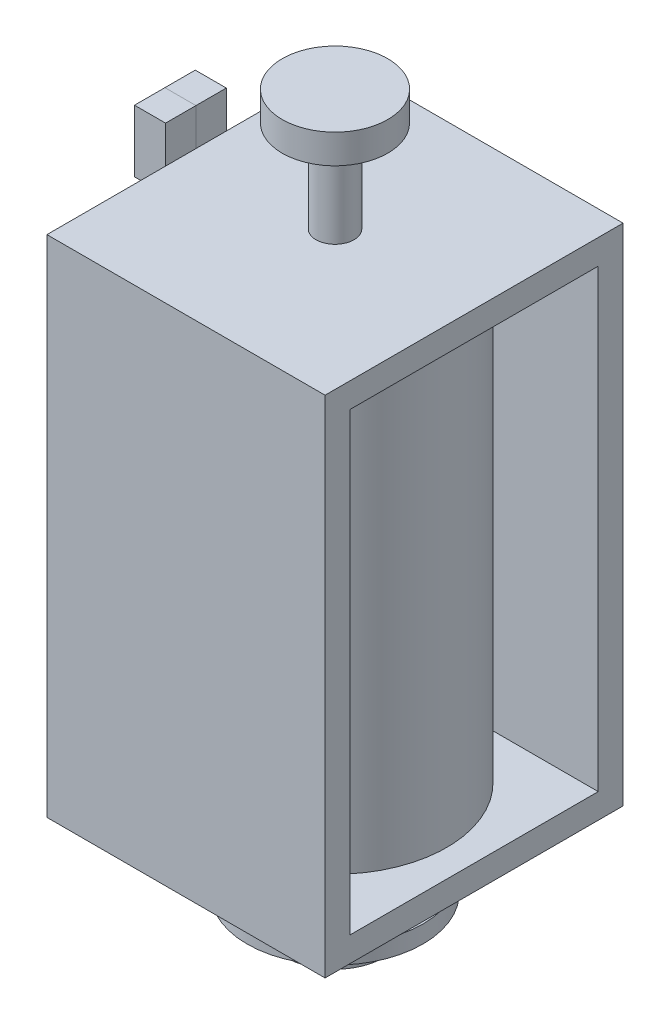
ISO-10303-21;
HEADER;
FILE_DESCRIPTION(('STEP AP214'),'2;1');
FILE_NAME('part.step','',(''),(''),'','','');
FILE_SCHEMA(('AUTOMOTIVE_DESIGN { 1 0 10303 214 1 1 1 1 }'));
ENDSEC;
DATA;
#1=APPLICATION_CONTEXT('core data for automotive mechanical design processes');
#2=APPLICATION_PROTOCOL_DEFINITION('international standard','automotive_design',2000,#1);
#3=PRODUCT_CONTEXT('',#1,'mechanical');
#4=PRODUCT('Part','Part','',(#3));
#5=PRODUCT_RELATED_PRODUCT_CATEGORY('part','',(#4));
#6=PRODUCT_DEFINITION_FORMATION('','',#4);
#7=PRODUCT_DEFINITION_CONTEXT('part definition',#1,'design');
#8=PRODUCT_DEFINITION('design','',#6,#7);
#9=PRODUCT_DEFINITION_SHAPE('','',#8);
#10=(LENGTH_UNIT() NAMED_UNIT(*) SI_UNIT(.MILLI.,.METRE.));
#11=(NAMED_UNIT(*) PLANE_ANGLE_UNIT() SI_UNIT($,.RADIAN.));
#12=(NAMED_UNIT(*) SI_UNIT($,.STERADIAN.) SOLID_ANGLE_UNIT());
#13=UNCERTAINTY_MEASURE_WITH_UNIT(LENGTH_MEASURE(1.E-05),#10,'distance_accuracy_value','');
#14=(GEOMETRIC_REPRESENTATION_CONTEXT(3) GLOBAL_UNCERTAINTY_ASSIGNED_CONTEXT((#13)) GLOBAL_UNIT_ASSIGNED_CONTEXT((#10,
#11,#12)) REPRESENTATION_CONTEXT('',''));
#15=CARTESIAN_POINT('',(0.,0.,0.));
#16=DIRECTION('',(0.,0.,1.));
#17=DIRECTION('',(1.,0.,0.));
#18=AXIS2_PLACEMENT_3D('',#15,#16,#17);
#19=CARTESIAN_POINT('',(0.,15.2781,0.));
#20=DIRECTION('',(0.,-1.,0.));
#21=DIRECTION('',(0.,0.,-1.));
#22=AXIS2_PLACEMENT_3D('',#19,#20,#21);
#23=CYLINDRICAL_SURFACE('',#22,2.159);
#24=CARTESIAN_POINT('',(0.,15.2781,0.));
#25=DIRECTION('',(0.,1.,0.));
#26=DIRECTION('',(0.,0.,1.));
#27=AXIS2_PLACEMENT_3D('',#24,#25,#26);
#28=CIRCLE('',#27,2.159);
#29=CARTESIAN_POINT('',(0.,15.2781,2.159));
#30=VERTEX_POINT('',#29);
#31=EDGE_CURVE('E11',#30,#30,#28,.T.);
#32=ORIENTED_EDGE('',*,*,#31,.F.);
#33=EDGE_LOOP('',(#32));
#34=FACE_BOUND('',#33,.T.);
#35=CARTESIAN_POINT('',(0.,14.0843,0.));
#36=DIRECTION('',(0.,1.,0.));
#37=DIRECTION('',(0.,0.,1.));
#38=AXIS2_PLACEMENT_3D('',#35,#36,#37);
#39=CIRCLE('',#38,2.159);
#40=CARTESIAN_POINT('',(0.,14.0843,2.159));
#41=VERTEX_POINT('',#40);
#42=EDGE_CURVE('E51',#41,#41,#39,.T.);
#43=ORIENTED_EDGE('',*,*,#42,.T.);
#44=EDGE_LOOP('',(#43));
#45=FACE_BOUND('',#44,.T.);
#46=ADVANCED_FACE('F48',(#34,#45),#23,.T.);
#47=CARTESIAN_POINT('',(0.,15.2781,0.));
#48=DIRECTION('',(0.,1.,0.));
#49=DIRECTION('',(0.,0.,1.));
#50=AXIS2_PLACEMENT_3D('',#47,#48,#49);
#51=PLANE('',#50);
#52=ORIENTED_EDGE('',*,*,#31,.T.);
#53=EDGE_LOOP('',(#52));
#54=FACE_BOUND('',#53,.T.);
#55=ADVANCED_FACE('F63',(#54),#51,.T.);
#56=CARTESIAN_POINT('',(0.,14.0843,0.));
#57=DIRECTION('',(0.,1.,0.));
#58=DIRECTION('',(0.,0.,1.));
#59=AXIS2_PLACEMENT_3D('',#56,#57,#58);
#60=PLANE('',#59);
#61=ORIENTED_EDGE('',*,*,#42,.F.);
#62=EDGE_LOOP('',(#61));
#63=FACE_BOUND('',#62,.T.);
#64=ADVANCED_FACE('F61',(#63),#60,.F.);
#65=CLOSED_SHELL('',(#46,#55,#64));
#66=MANIFOLD_SOLID_BREP('B2',#65);
#67=CARTESIAN_POINT('',(-6.9596,0.,1.24287012850082));
#68=DIRECTION('',(0.,0.,1.));
#69=DIRECTION('',(0.,-1.,0.));
#70=AXIS2_PLACEMENT_3D('',#67,#68,#69);
#71=PLANE('',#70);
#72=DIRECTION('',(0.,-1.,0.));
#73=VECTOR('',#72,1.);
#74=CARTESIAN_POINT('',(-5.6896,0.,1.24287012850082));
#75=LINE('',#74,#73);
#76=CARTESIAN_POINT('',(-5.6896,11.8491,1.24287012850082));
#77=VERTEX_POINT('',#76);
#78=CARTESIAN_POINT('',(-5.6896,9.3091,1.24287012850082));
#79=VERTEX_POINT('',#78);
#80=EDGE_CURVE('E162',#77,#79,#75,.T.);
#81=ORIENTED_EDGE('',*,*,#80,.F.);
#82=DIRECTION('',(1.,0.,0.));
#83=VECTOR('',#82,1.);
#84=CARTESIAN_POINT('',(-6.9596,11.8491,1.24287012850082));
#85=LINE('',#84,#83);
#86=CARTESIAN_POINT('',(-6.9596,11.8491,1.24287012850082));
#87=VERTEX_POINT('',#86);
#88=EDGE_CURVE('E46',#87,#77,#85,.T.);
#89=ORIENTED_EDGE('',*,*,#88,.F.);
#90=DIRECTION('',(0.,-1.,0.));
#91=VECTOR('',#90,1.);
#92=CARTESIAN_POINT('',(-6.9596,0.,1.24287012850082));
#93=LINE('',#92,#91);
#94=CARTESIAN_POINT('',(-6.9596,9.3091,1.24287012850082));
#95=VERTEX_POINT('',#94);
#96=EDGE_CURVE('E155',#87,#95,#93,.T.);
#97=ORIENTED_EDGE('',*,*,#96,.T.);
#98=DIRECTION('',(1.,0.,0.));
#99=VECTOR('',#98,1.);
#100=CARTESIAN_POINT('',(-6.9596,9.3091,1.24287012850082));
#101=LINE('',#100,#99);
#102=EDGE_CURVE('E137',#95,#79,#101,.T.);
#103=ORIENTED_EDGE('',*,*,#102,.T.);
#104=EDGE_LOOP('',(#81,#89,#97,#103));
#105=FACE_BOUND('',#104,.T.);
#106=ADVANCED_FACE('F99',(#105),#71,.T.);
#107=CARTESIAN_POINT('',(-6.9596,11.8491,0.));
#108=DIRECTION('',(0.,1.,0.));
#109=DIRECTION('',(0.,0.,1.));
#110=AXIS2_PLACEMENT_3D('',#107,#108,#109);
#111=PLANE('',#110);
#112=DIRECTION('',(0.,0.,1.));
#113=VECTOR('',#112,1.);
#114=CARTESIAN_POINT('',(-5.6896,11.8491,0.));
#115=LINE('',#114,#113);
#116=CARTESIAN_POINT('',(-5.6896,11.8491,0.));
#117=VERTEX_POINT('',#116);
#118=EDGE_CURVE('E148',#117,#77,#115,.T.);
#119=ORIENTED_EDGE('',*,*,#118,.F.);
#120=DIRECTION('',(1.,0.,0.));
#121=VECTOR('',#120,1.);
#122=CARTESIAN_POINT('',(-6.9596,11.8491,0.));
#123=LINE('',#122,#121);
#124=CARTESIAN_POINT('',(-6.9596,11.8491,0.));
#125=VERTEX_POINT('',#124);
#126=EDGE_CURVE('E107',#125,#117,#123,.T.);
#127=ORIENTED_EDGE('',*,*,#126,.F.);
#128=DIRECTION('',(0.,0.,1.));
#129=VECTOR('',#128,1.);
#130=CARTESIAN_POINT('',(-6.9596,11.8491,0.));
#131=LINE('',#130,#129);
#132=EDGE_CURVE('E146',#125,#87,#131,.T.);
#133=ORIENTED_EDGE('',*,*,#132,.T.);
#134=ORIENTED_EDGE('',*,*,#88,.T.);
#135=EDGE_LOOP('',(#119,#127,#133,#134));
#136=FACE_BOUND('',#135,.T.);
#137=ADVANCED_FACE('F145',(#136),#111,.T.);
#138=CARTESIAN_POINT('',(-6.9596,0.,0.));
#139=DIRECTION('',(0.,0.,-1.));
#140=DIRECTION('',(-1.,0.,0.));
#141=AXIS2_PLACEMENT_3D('',#138,#139,#140);
#142=PLANE('',#141);
#143=DIRECTION('',(0.,1.,0.));
#144=VECTOR('',#143,1.);
#145=CARTESIAN_POINT('',(-5.6896,0.,0.));
#146=LINE('',#145,#144);
#147=CARTESIAN_POINT('',(-5.6896,9.3091,0.));
#148=VERTEX_POINT('',#147);
#149=EDGE_CURVE('E166',#148,#117,#146,.T.);
#150=ORIENTED_EDGE('',*,*,#149,.F.);
#151=DIRECTION('',(1.,0.,0.));
#152=VECTOR('',#151,1.);
#153=CARTESIAN_POINT('',(-6.9596,9.3091,0.));
#154=LINE('',#153,#152);
#155=CARTESIAN_POINT('',(-6.9596,9.3091,0.));
#156=VERTEX_POINT('',#155);
#157=EDGE_CURVE('E130',#156,#148,#154,.T.);
#158=ORIENTED_EDGE('',*,*,#157,.F.);
#159=DIRECTION('',(0.,1.,0.));
#160=VECTOR('',#159,1.);
#161=CARTESIAN_POINT('',(-6.9596,0.,0.));
#162=LINE('',#161,#160);
#163=EDGE_CURVE('E154',#156,#125,#162,.T.);
#164=ORIENTED_EDGE('',*,*,#163,.T.);
#165=ORIENTED_EDGE('',*,*,#126,.T.);
#166=EDGE_LOOP('',(#150,#158,#164,#165));
#167=FACE_BOUND('',#166,.T.);
#168=ADVANCED_FACE('F157',(#167),#142,.T.);
#169=CARTESIAN_POINT('',(-6.9596,9.3091,0.));
#170=DIRECTION('',(0.,1.,0.));
#171=DIRECTION('',(0.,0.,1.));
#172=AXIS2_PLACEMENT_3D('',#169,#170,#171);
#173=PLANE('',#172);
#174=DIRECTION('',(0.,0.,1.));
#175=VECTOR('',#174,1.);
#176=CARTESIAN_POINT('',(-5.6896,9.3091,0.));
#177=LINE('',#176,#175);
#178=EDGE_CURVE('E168',#148,#79,#177,.T.);
#179=ORIENTED_EDGE('',*,*,#178,.T.);
#180=ORIENTED_EDGE('',*,*,#102,.F.);
#181=DIRECTION('',(0.,0.,1.));
#182=VECTOR('',#181,1.);
#183=CARTESIAN_POINT('',(-6.9596,9.3091,0.));
#184=LINE('',#183,#182);
#185=EDGE_CURVE('E115',#156,#95,#184,.T.);
#186=ORIENTED_EDGE('',*,*,#185,.F.);
#187=ORIENTED_EDGE('',*,*,#157,.T.);
#188=EDGE_LOOP('',(#179,#180,#186,#187));
#189=FACE_BOUND('',#188,.T.);
#190=ADVANCED_FACE('F178',(#189),#173,.F.);
#191=CARTESIAN_POINT('',(-6.9596,0.,0.));
#192=DIRECTION('',(-1.,0.,0.));
#193=DIRECTION('',(0.,0.,1.));
#194=AXIS2_PLACEMENT_3D('',#191,#192,#193);
#195=PLANE('',#194);
#196=ORIENTED_EDGE('',*,*,#96,.F.);
#197=ORIENTED_EDGE('',*,*,#132,.F.);
#198=ORIENTED_EDGE('',*,*,#163,.F.);
#199=ORIENTED_EDGE('',*,*,#185,.T.);
#200=EDGE_LOOP('',(#196,#197,#198,#199));
#201=FACE_BOUND('',#200,.T.);
#202=ADVANCED_FACE('F153',(#201),#195,.T.);
#203=CARTESIAN_POINT('',(-5.6896,0.,0.));
#204=DIRECTION('',(-1.,0.,0.));
#205=DIRECTION('',(0.,0.,1.));
#206=AXIS2_PLACEMENT_3D('',#203,#204,#205);
#207=PLANE('',#206);
#208=ORIENTED_EDGE('',*,*,#80,.T.);
#209=ORIENTED_EDGE('',*,*,#178,.F.);
#210=ORIENTED_EDGE('',*,*,#149,.T.);
#211=ORIENTED_EDGE('',*,*,#118,.T.);
#212=EDGE_LOOP('',(#208,#209,#210,#211));
#213=FACE_BOUND('',#212,.T.);
#214=ADVANCED_FACE('F183',(#213),#207,.F.);
#215=CLOSED_SHELL('',(#106,#137,#168,#190,#202,#214));
#216=MANIFOLD_SOLID_BREP('B6',#215);
#217=CARTESIAN_POINT('',(-6.9596,0.,0.));
#218=DIRECTION('',(0.,0.,-1.));
#219=DIRECTION('',(-1.,0.,0.));
#220=AXIS2_PLACEMENT_3D('',#217,#218,#219);
#221=PLANE('',#220);
#222=DIRECTION('',(0.,1.,0.));
#223=VECTOR('',#222,1.);
#224=CARTESIAN_POINT('',(-5.6896,0.,0.));
#225=LINE('',#224,#223);
#226=CARTESIAN_POINT('',(-5.6896,9.3091,0.));
#227=VERTEX_POINT('',#226);
#228=CARTESIAN_POINT('',(-5.6896,11.8491,0.));
#229=VERTEX_POINT('',#228);
#230=EDGE_CURVE('E306',#227,#229,#225,.T.);
#231=ORIENTED_EDGE('',*,*,#230,.T.);
#232=DIRECTION('',(1.,0.,0.));
#233=VECTOR('',#232,1.);
#234=CARTESIAN_POINT('',(-6.9596,11.8491,0.));
#235=LINE('',#234,#233);
#236=CARTESIAN_POINT('',(-6.9596,11.8491,0.));
#237=VERTEX_POINT('',#236);
#238=EDGE_CURVE('E97',#237,#229,#235,.T.);
#239=ORIENTED_EDGE('',*,*,#238,.F.);
#240=DIRECTION('',(0.,1.,0.));
#241=VECTOR('',#240,1.);
#242=CARTESIAN_POINT('',(-6.9596,0.,0.));
#243=LINE('',#242,#241);
#244=CARTESIAN_POINT('',(-6.9596,9.3091,0.));
#245=VERTEX_POINT('',#244);
#246=EDGE_CURVE('E294',#245,#237,#243,.T.);
#247=ORIENTED_EDGE('',*,*,#246,.F.);
#248=DIRECTION('',(1.,0.,0.));
#249=VECTOR('',#248,1.);
#250=CARTESIAN_POINT('',(-6.9596,9.3091,0.));
#251=LINE('',#250,#249);
#252=EDGE_CURVE('E302',#245,#227,#251,.T.);
#253=ORIENTED_EDGE('',*,*,#252,.T.);
#254=EDGE_LOOP('',(#231,#239,#247,#253));
#255=FACE_BOUND('',#254,.T.);
#256=ADVANCED_FACE('F243',(#255),#221,.F.);
#257=CARTESIAN_POINT('',(-6.9596,11.8491,0.));
#258=DIRECTION('',(0.,-1.,0.));
#259=DIRECTION('',(0.,0.,-1.));
#260=AXIS2_PLACEMENT_3D('',#257,#258,#259);
#261=PLANE('',#260);
#262=DIRECTION('',(0.,0.,-1.));
#263=VECTOR('',#262,1.);
#264=CARTESIAN_POINT('',(-5.6896,11.8491,0.));
#265=LINE('',#264,#263);
#266=CARTESIAN_POINT('',(-5.6896,11.8491,-1.24287012850082));
#267=VERTEX_POINT('',#266);
#268=EDGE_CURVE('E298',#229,#267,#265,.T.);
#269=ORIENTED_EDGE('',*,*,#268,.T.);
#270=DIRECTION('',(1.,0.,0.));
#271=VECTOR('',#270,1.);
#272=CARTESIAN_POINT('',(-6.9596,11.8491,-1.24287012850082));
#273=LINE('',#272,#271);
#274=CARTESIAN_POINT('',(-6.9596,11.8491,-1.24287012850082));
#275=VERTEX_POINT('',#274);
#276=EDGE_CURVE('E251',#275,#267,#273,.T.);
#277=ORIENTED_EDGE('',*,*,#276,.F.);
#278=DIRECTION('',(0.,0.,-1.));
#279=VECTOR('',#278,1.);
#280=CARTESIAN_POINT('',(-6.9596,11.8491,0.));
#281=LINE('',#280,#279);
#282=EDGE_CURVE('E289',#237,#275,#281,.T.);
#283=ORIENTED_EDGE('',*,*,#282,.F.);
#284=ORIENTED_EDGE('',*,*,#238,.T.);
#285=EDGE_LOOP('',(#269,#277,#283,#284));
#286=FACE_BOUND('',#285,.T.);
#287=ADVANCED_FACE('F297',(#286),#261,.F.);
#288=CARTESIAN_POINT('',(-6.9596,0.,-1.24287012850082));
#289=DIRECTION('',(0.,0.,1.));
#290=DIRECTION('',(0.,-1.,0.));
#291=AXIS2_PLACEMENT_3D('',#288,#289,#290);
#292=PLANE('',#291);
#293=DIRECTION('',(0.,-1.,0.));
#294=VECTOR('',#293,1.);
#295=CARTESIAN_POINT('',(-5.6896,0.,-1.24287012850082));
#296=LINE('',#295,#294);
#297=CARTESIAN_POINT('',(-5.6896,9.3091,-1.24287012850082));
#298=VERTEX_POINT('',#297);
#299=EDGE_CURVE('E276',#267,#298,#296,.T.);
#300=ORIENTED_EDGE('',*,*,#299,.T.);
#301=DIRECTION('',(1.,0.,0.));
#302=VECTOR('',#301,1.);
#303=CARTESIAN_POINT('',(-6.9596,9.3091,-1.24287012850082));
#304=LINE('',#303,#302);
#305=CARTESIAN_POINT('',(-6.9596,9.3091,-1.24287012850082));
#306=VERTEX_POINT('',#305);
#307=EDGE_CURVE('E299',#306,#298,#304,.T.);
#308=ORIENTED_EDGE('',*,*,#307,.F.);
#309=DIRECTION('',(0.,-1.,0.));
#310=VECTOR('',#309,1.);
#311=CARTESIAN_POINT('',(-6.9596,0.,-1.24287012850082));
#312=LINE('',#311,#310);
#313=EDGE_CURVE('E292',#275,#306,#312,.T.);
#314=ORIENTED_EDGE('',*,*,#313,.F.);
#315=ORIENTED_EDGE('',*,*,#276,.T.);
#316=EDGE_LOOP('',(#300,#308,#314,#315));
#317=FACE_BOUND('',#316,.T.);
#318=ADVANCED_FACE('F300',(#317),#292,.F.);
#319=CARTESIAN_POINT('',(-6.9596,9.3091,0.));
#320=DIRECTION('',(0.,1.,0.));
#321=DIRECTION('',(0.,0.,1.));
#322=AXIS2_PLACEMENT_3D('',#319,#320,#321);
#323=PLANE('',#322);
#324=DIRECTION('',(0.,0.,1.));
#325=VECTOR('',#324,1.);
#326=CARTESIAN_POINT('',(-5.6896,9.3091,0.));
#327=LINE('',#326,#325);
#328=EDGE_CURVE('E282',#298,#227,#327,.T.);
#329=ORIENTED_EDGE('',*,*,#328,.T.);
#330=ORIENTED_EDGE('',*,*,#252,.F.);
#331=DIRECTION('',(0.,0.,1.));
#332=VECTOR('',#331,1.);
#333=CARTESIAN_POINT('',(-6.9596,9.3091,0.));
#334=LINE('',#333,#332);
#335=EDGE_CURVE('E259',#306,#245,#334,.T.);
#336=ORIENTED_EDGE('',*,*,#335,.F.);
#337=ORIENTED_EDGE('',*,*,#307,.T.);
#338=EDGE_LOOP('',(#329,#330,#336,#337));
#339=FACE_BOUND('',#338,.T.);
#340=ADVANCED_FACE('F313',(#339),#323,.F.);
#341=CARTESIAN_POINT('',(-6.9596,0.,0.));
#342=DIRECTION('',(-1.,0.,0.));
#343=DIRECTION('',(0.,0.,1.));
#344=AXIS2_PLACEMENT_3D('',#341,#342,#343);
#345=PLANE('',#344);
#346=ORIENTED_EDGE('',*,*,#246,.T.);
#347=ORIENTED_EDGE('',*,*,#282,.T.);
#348=ORIENTED_EDGE('',*,*,#313,.T.);
#349=ORIENTED_EDGE('',*,*,#335,.T.);
#350=EDGE_LOOP('',(#346,#347,#348,#349));
#351=FACE_BOUND('',#350,.T.);
#352=ADVANCED_FACE('F290',(#351),#345,.T.);
#353=CARTESIAN_POINT('',(-5.6896,0.,0.));
#354=DIRECTION('',(-1.,0.,0.));
#355=DIRECTION('',(0.,0.,1.));
#356=AXIS2_PLACEMENT_3D('',#353,#354,#355);
#357=PLANE('',#356);
#358=ORIENTED_EDGE('',*,*,#230,.F.);
#359=ORIENTED_EDGE('',*,*,#328,.F.);
#360=ORIENTED_EDGE('',*,*,#299,.F.);
#361=ORIENTED_EDGE('',*,*,#268,.F.);
#362=EDGE_LOOP('',(#358,#359,#360,#361));
#363=FACE_BOUND('',#362,.T.);
#364=ADVANCED_FACE('F316',(#363),#357,.F.);
#365=CLOSED_SHELL('',(#256,#287,#318,#340,#352,#364));
#366=MANIFOLD_SOLID_BREP('B40',#365);
#367=CARTESIAN_POINT('',(0.,14.0843,0.));
#368=DIRECTION('',(0.,-1.,0.));
#369=DIRECTION('',(0.,0.,-1.));
#370=AXIS2_PLACEMENT_3D('',#367,#368,#369);
#371=CYLINDRICAL_SURFACE('',#370,0.7747);
#372=CARTESIAN_POINT('',(0.,14.0843,0.));
#373=DIRECTION('',(0.,1.,0.));
#374=DIRECTION('',(0.,0.,1.));
#375=AXIS2_PLACEMENT_3D('',#372,#373,#374);
#376=CIRCLE('',#375,0.7747);
#377=CARTESIAN_POINT('',(0.,14.0843,0.7747));
#378=VERTEX_POINT('',#377);
#379=EDGE_CURVE('E242',#378,#378,#376,.T.);
#380=ORIENTED_EDGE('',*,*,#379,.F.);
#381=EDGE_LOOP('',(#380));
#382=FACE_BOUND('',#381,.T.);
#383=CARTESIAN_POINT('',(0.,10.3251,0.));
#384=DIRECTION('',(0.,1.,0.));
#385=DIRECTION('',(0.,0.,1.));
#386=AXIS2_PLACEMENT_3D('',#383,#384,#385);
#387=CIRCLE('',#386,0.7747);
#388=CARTESIAN_POINT('',(0.,10.3251,0.7747));
#389=VERTEX_POINT('',#388);
#390=EDGE_CURVE('E391',#389,#389,#387,.T.);
#391=ORIENTED_EDGE('',*,*,#390,.T.);
#392=EDGE_LOOP('',(#391));
#393=FACE_BOUND('',#392,.T.);
#394=ADVANCED_FACE('F388',(#382,#393),#371,.T.);
#395=CARTESIAN_POINT('',(0.,14.0843,0.));
#396=DIRECTION('',(0.,1.,0.));
#397=DIRECTION('',(0.,0.,1.));
#398=AXIS2_PLACEMENT_3D('',#395,#396,#397);
#399=PLANE('',#398);
#400=ORIENTED_EDGE('',*,*,#379,.T.);
#401=EDGE_LOOP('',(#400));
#402=FACE_BOUND('',#401,.T.);
#403=ADVANCED_FACE('F403',(#402),#399,.T.);
#404=CARTESIAN_POINT('',(0.,10.3251,0.));
#405=DIRECTION('',(0.,1.,0.));
#406=DIRECTION('',(0.,0.,1.));
#407=AXIS2_PLACEMENT_3D('',#404,#405,#406);
#408=PLANE('',#407);
#409=ORIENTED_EDGE('',*,*,#390,.F.);
#410=EDGE_LOOP('',(#409));
#411=FACE_BOUND('',#410,.T.);
#412=ADVANCED_FACE('F401',(#411),#408,.F.);
#413=CLOSED_SHELL('',(#394,#403,#412));
#414=MANIFOLD_SOLID_BREP('B91',#413);
#415=CARTESIAN_POINT('',(5.6896,0.,0.));
#416=DIRECTION('',(1.,0.,0.));
#417=DIRECTION('',(0.,0.,-1.));
#418=AXIS2_PLACEMENT_3D('',#415,#416,#417);
#419=PLANE('',#418);
#420=DIRECTION('',(0.,-1.,0.));
#421=VECTOR('',#420,1.);
#422=CARTESIAN_POINT('',(5.6896,-10.3251,6.096));
#423=LINE('',#422,#421);
#424=CARTESIAN_POINT('',(5.6896,10.3251,6.096));
#425=VERTEX_POINT('',#424);
#426=CARTESIAN_POINT('',(5.6896,-10.3251,6.096));
#427=VERTEX_POINT('',#426);
#428=EDGE_CURVE('E583',#425,#427,#423,.T.);
#429=ORIENTED_EDGE('',*,*,#428,.T.);
#430=DIRECTION('',(0.,0.,-1.));
#431=VECTOR('',#430,1.);
#432=CARTESIAN_POINT('',(5.6896,-10.3251,-6.096));
#433=LINE('',#432,#431);
#434=CARTESIAN_POINT('',(5.6896,-10.3251,-6.096));
#435=VERTEX_POINT('',#434);
#436=EDGE_CURVE('E586',#427,#435,#433,.T.);
#437=ORIENTED_EDGE('',*,*,#436,.T.);
#438=DIRECTION('',(0.,1.,0.));
#439=VECTOR('',#438,1.);
#440=CARTESIAN_POINT('',(5.6896,-10.3251,-6.096));
#441=LINE('',#440,#439);
#442=CARTESIAN_POINT('',(5.6896,10.3251,-6.096));
#443=VERTEX_POINT('',#442);
#444=EDGE_CURVE('E589',#435,#443,#441,.T.);
#445=ORIENTED_EDGE('',*,*,#444,.T.);
#446=DIRECTION('',(0.,0.,1.));
#447=VECTOR('',#446,1.);
#448=CARTESIAN_POINT('',(5.6896,10.3251,-6.096));
#449=LINE('',#448,#447);
#450=EDGE_CURVE('E591',#443,#425,#449,.T.);
#451=ORIENTED_EDGE('',*,*,#450,.T.);
#452=EDGE_LOOP('',(#429,#437,#445,#451));
#453=FACE_BOUND('',#452,.T.);
#454=DIRECTION('',(0.,0.,-1.));
#455=VECTOR('',#454,1.);
#456=CARTESIAN_POINT('',(5.6896,-9.3091,-5.08));
#457=LINE('',#456,#455);
#458=CARTESIAN_POINT('',(5.6896,-9.3091,5.08));
#459=VERTEX_POINT('',#458);
#460=CARTESIAN_POINT('',(5.6896,-9.3091,-5.08));
#461=VERTEX_POINT('',#460);
#462=EDGE_CURVE('E554',#459,#461,#457,.T.);
#463=ORIENTED_EDGE('',*,*,#462,.F.);
#464=DIRECTION('',(0.,-1.,0.));
#465=VECTOR('',#464,1.);
#466=CARTESIAN_POINT('',(5.6896,-9.3091,5.08));
#467=LINE('',#466,#465);
#468=CARTESIAN_POINT('',(5.6896,9.3091,5.08));
#469=VERTEX_POINT('',#468);
#470=EDGE_CURVE('E552',#469,#459,#467,.T.);
#471=ORIENTED_EDGE('',*,*,#470,.F.);
#472=DIRECTION('',(0.,0.,1.));
#473=VECTOR('',#472,1.);
#474=CARTESIAN_POINT('',(5.6896,9.3091,-5.08));
#475=LINE('',#474,#473);
#476=CARTESIAN_POINT('',(5.6896,9.3091,-5.08));
#477=VERTEX_POINT('',#476);
#478=EDGE_CURVE('E560',#477,#469,#475,.T.);
#479=ORIENTED_EDGE('',*,*,#478,.F.);
#480=DIRECTION('',(0.,1.,0.));
#481=VECTOR('',#480,1.);
#482=CARTESIAN_POINT('',(5.6896,-9.3091,-5.08));
#483=LINE('',#482,#481);
#484=EDGE_CURVE('E557',#461,#477,#483,.T.);
#485=ORIENTED_EDGE('',*,*,#484,.F.);
#486=EDGE_LOOP('',(#463,#471,#479,#485));
#487=FACE_BOUND('',#486,.T.);
#488=ADVANCED_FACE('F429',(#453,#487),#419,.T.);
#489=CARTESIAN_POINT('',(-5.6896,0.,0.));
#490=DIRECTION('',(1.,0.,0.));
#491=DIRECTION('',(0.,0.,-1.));
#492=AXIS2_PLACEMENT_3D('',#489,#490,#491);
#493=PLANE('',#492);
#494=DIRECTION('',(0.,-1.,0.));
#495=VECTOR('',#494,1.);
#496=CARTESIAN_POINT('',(-5.6896,-10.3251,6.096));
#497=LINE('',#496,#495);
#498=CARTESIAN_POINT('',(-5.6896,10.3251,6.096));
#499=VERTEX_POINT('',#498);
#500=CARTESIAN_POINT('',(-5.6896,-10.3251,6.096));
#501=VERTEX_POINT('',#500);
#502=EDGE_CURVE('E582',#499,#501,#497,.T.);
#503=ORIENTED_EDGE('',*,*,#502,.F.);
#504=DIRECTION('',(0.,0.,1.));
#505=VECTOR('',#504,1.);
#506=CARTESIAN_POINT('',(-5.6896,10.3251,-6.096));
#507=LINE('',#506,#505);
#508=CARTESIAN_POINT('',(-5.6896,10.3251,-6.096));
#509=VERTEX_POINT('',#508);
#510=EDGE_CURVE('E587',#509,#499,#507,.T.);
#511=ORIENTED_EDGE('',*,*,#510,.F.);
#512=DIRECTION('',(0.,1.,0.));
#513=VECTOR('',#512,1.);
#514=CARTESIAN_POINT('',(-5.6896,-10.3251,-6.096));
#515=LINE('',#514,#513);
#516=CARTESIAN_POINT('',(-5.6896,-10.3251,-6.096));
#517=VERTEX_POINT('',#516);
#518=EDGE_CURVE('E598',#517,#509,#515,.T.);
#519=ORIENTED_EDGE('',*,*,#518,.F.);
#520=DIRECTION('',(0.,0.,-1.));
#521=VECTOR('',#520,1.);
#522=CARTESIAN_POINT('',(-5.6896,-10.3251,-6.096));
#523=LINE('',#522,#521);
#524=EDGE_CURVE('E596',#501,#517,#523,.T.);
#525=ORIENTED_EDGE('',*,*,#524,.F.);
#526=EDGE_LOOP('',(#503,#511,#519,#525));
#527=FACE_BOUND('',#526,.T.);
#528=DIRECTION('',(0.,-1.,0.));
#529=VECTOR('',#528,1.);
#530=CARTESIAN_POINT('',(-5.6896,-9.3091,5.08));
#531=LINE('',#530,#529);
#532=CARTESIAN_POINT('',(-5.6896,9.3091,5.08));
#533=VERTEX_POINT('',#532);
#534=CARTESIAN_POINT('',(-5.6896,-9.3091,5.08));
#535=VERTEX_POINT('',#534);
#536=EDGE_CURVE('E551',#533,#535,#531,.T.);
#537=ORIENTED_EDGE('',*,*,#536,.T.);
#538=DIRECTION('',(0.,0.,-1.));
#539=VECTOR('',#538,1.);
#540=CARTESIAN_POINT('',(-5.6896,-9.3091,-5.08));
#541=LINE('',#540,#539);
#542=CARTESIAN_POINT('',(-5.6896,-9.3091,-5.08));
#543=VERTEX_POINT('',#542);
#544=EDGE_CURVE('E565',#535,#543,#541,.T.);
#545=ORIENTED_EDGE('',*,*,#544,.T.);
#546=DIRECTION('',(0.,1.,0.));
#547=VECTOR('',#546,1.);
#548=CARTESIAN_POINT('',(-5.6896,-9.3091,-5.08));
#549=LINE('',#548,#547);
#550=CARTESIAN_POINT('',(-5.6896,9.3091,-5.08));
#551=VERTEX_POINT('',#550);
#552=EDGE_CURVE('E568',#543,#551,#549,.T.);
#553=ORIENTED_EDGE('',*,*,#552,.T.);
#554=DIRECTION('',(0.,0.,1.));
#555=VECTOR('',#554,1.);
#556=CARTESIAN_POINT('',(-5.6896,9.3091,-5.08));
#557=LINE('',#556,#555);
#558=EDGE_CURVE('E555',#551,#533,#557,.T.);
#559=ORIENTED_EDGE('',*,*,#558,.T.);
#560=EDGE_LOOP('',(#537,#545,#553,#559));
#561=FACE_BOUND('',#560,.T.);
#562=ADVANCED_FACE('F619',(#527,#561),#493,.F.);
#563=CARTESIAN_POINT('',(5.6896,-10.3251,6.096));
#564=DIRECTION('',(0.,0.,-1.));
#565=DIRECTION('',(-1.,0.,0.));
#566=AXIS2_PLACEMENT_3D('',#563,#564,#565);
#567=PLANE('',#566);
#568=ORIENTED_EDGE('',*,*,#502,.T.);
#569=DIRECTION('',(-1.,0.,0.));
#570=VECTOR('',#569,1.);
#571=CARTESIAN_POINT('',(5.6896,-10.3251,6.096));
#572=LINE('',#571,#570);
#573=EDGE_CURVE('E438',#427,#501,#572,.T.);
#574=ORIENTED_EDGE('',*,*,#573,.F.);
#575=ORIENTED_EDGE('',*,*,#428,.F.);
#576=DIRECTION('',(-1.,0.,0.));
#577=VECTOR('',#576,1.);
#578=CARTESIAN_POINT('',(5.6896,10.3251,6.096));
#579=LINE('',#578,#577);
#580=EDGE_CURVE('E593',#425,#499,#579,.T.);
#581=ORIENTED_EDGE('',*,*,#580,.T.);
#582=EDGE_LOOP('',(#568,#574,#575,#581));
#583=FACE_BOUND('',#582,.T.);
#584=ADVANCED_FACE('F431',(#583),#567,.F.);
#585=CARTESIAN_POINT('',(5.6896,-10.3251,-6.096));
#586=DIRECTION('',(0.,1.,0.));
#587=DIRECTION('',(0.,0.,1.));
#588=AXIS2_PLACEMENT_3D('',#585,#586,#587);
#589=PLANE('',#588);
#590=CARTESIAN_POINT('',(0.,-10.3251,0.));
#591=DIRECTION('',(0.,-1.,0.));
#592=DIRECTION('',(0.,0.,-1.));
#593=AXIS2_PLACEMENT_3D('',#590,#591,#592);
#594=CIRCLE('',#593,2.0066);
#595=CARTESIAN_POINT('',(0.,-10.3251,-2.0066));
#596=VERTEX_POINT('',#595);
#597=EDGE_CURVE('E386',#596,#596,#594,.T.);
#598=ORIENTED_EDGE('',*,*,#597,.F.);
#599=EDGE_LOOP('',(#598));
#600=FACE_BOUND('',#599,.T.);
#601=ORIENTED_EDGE('',*,*,#524,.T.);
#602=DIRECTION('',(-1.,0.,0.));
#603=VECTOR('',#602,1.);
#604=CARTESIAN_POINT('',(5.6896,-10.3251,-6.096));
#605=LINE('',#604,#603);
#606=EDGE_CURVE('E606',#435,#517,#605,.T.);
#607=ORIENTED_EDGE('',*,*,#606,.F.);
#608=ORIENTED_EDGE('',*,*,#436,.F.);
#609=ORIENTED_EDGE('',*,*,#573,.T.);
#610=EDGE_LOOP('',(#601,#607,#608,#609));
#611=FACE_BOUND('',#610,.T.);
#612=ADVANCED_FACE('F611',(#600,#611),#589,.F.);
#613=CARTESIAN_POINT('',(5.6896,-10.3251,-6.096));
#614=DIRECTION('',(0.,0.,1.));
#615=DIRECTION('',(1.,0.,0.));
#616=AXIS2_PLACEMENT_3D('',#613,#614,#615);
#617=PLANE('',#616);
#618=ORIENTED_EDGE('',*,*,#518,.T.);
#619=DIRECTION('',(-1.,0.,0.));
#620=VECTOR('',#619,1.);
#621=CARTESIAN_POINT('',(5.6896,10.3251,-6.096));
#622=LINE('',#621,#620);
#623=EDGE_CURVE('E603',#443,#509,#622,.T.);
#624=ORIENTED_EDGE('',*,*,#623,.F.);
#625=ORIENTED_EDGE('',*,*,#444,.F.);
#626=ORIENTED_EDGE('',*,*,#606,.T.);
#627=EDGE_LOOP('',(#618,#624,#625,#626));
#628=FACE_BOUND('',#627,.T.);
#629=ADVANCED_FACE('F624',(#628),#617,.F.);
#630=CARTESIAN_POINT('',(5.6896,10.3251,-6.096));
#631=DIRECTION('',(0.,-1.,0.));
#632=DIRECTION('',(0.,0.,-1.));
#633=AXIS2_PLACEMENT_3D('',#630,#631,#632);
#634=PLANE('',#633);
#635=ORIENTED_EDGE('',*,*,#510,.T.);
#636=ORIENTED_EDGE('',*,*,#580,.F.);
#637=ORIENTED_EDGE('',*,*,#450,.F.);
#638=ORIENTED_EDGE('',*,*,#623,.T.);
#639=EDGE_LOOP('',(#635,#636,#637,#638));
#640=FACE_BOUND('',#639,.T.);
#641=ADVANCED_FACE('F628',(#640),#634,.F.);
#642=CARTESIAN_POINT('',(5.6896,-9.3091,5.08));
#643=DIRECTION('',(0.,0.,-1.));
#644=DIRECTION('',(-1.,0.,0.));
#645=AXIS2_PLACEMENT_3D('',#642,#643,#644);
#646=PLANE('',#645);
#647=ORIENTED_EDGE('',*,*,#536,.F.);
#648=DIRECTION('',(-1.,0.,0.));
#649=VECTOR('',#648,1.);
#650=CARTESIAN_POINT('',(5.6896,9.3091,5.08));
#651=LINE('',#650,#649);
#652=EDGE_CURVE('E562',#469,#533,#651,.T.);
#653=ORIENTED_EDGE('',*,*,#652,.F.);
#654=ORIENTED_EDGE('',*,*,#470,.T.);
#655=DIRECTION('',(-1.,0.,0.));
#656=VECTOR('',#655,1.);
#657=CARTESIAN_POINT('',(5.6896,-9.3091,5.08));
#658=LINE('',#657,#656);
#659=EDGE_CURVE('E579',#459,#535,#658,.T.);
#660=ORIENTED_EDGE('',*,*,#659,.T.);
#661=EDGE_LOOP('',(#647,#653,#654,#660));
#662=FACE_BOUND('',#661,.T.);
#663=ADVANCED_FACE('F646',(#662),#646,.T.);
#664=CARTESIAN_POINT('',(5.6896,-9.3091,-5.08));
#665=DIRECTION('',(0.,1.,0.));
#666=DIRECTION('',(0.,0.,1.));
#667=AXIS2_PLACEMENT_3D('',#664,#665,#666);
#668=PLANE('',#667);
#669=CARTESIAN_POINT('',(0.,-9.3091,0.));
#670=DIRECTION('',(0.,1.,0.));
#671=DIRECTION('',(0.,0.,1.));
#672=AXIS2_PLACEMENT_3D('',#669,#670,#671);
#673=CIRCLE('',#672,4.572);
#674=CARTESIAN_POINT('',(0.,-9.3091,4.572));
#675=VERTEX_POINT('',#674);
#676=EDGE_CURVE('E548',#675,#675,#673,.F.);
#677=ORIENTED_EDGE('',*,*,#676,.T.);
#678=EDGE_LOOP('',(#677));
#679=FACE_BOUND('',#678,.T.);
#680=ORIENTED_EDGE('',*,*,#544,.F.);
#681=ORIENTED_EDGE('',*,*,#659,.F.);
#682=ORIENTED_EDGE('',*,*,#462,.T.);
#683=DIRECTION('',(-1.,0.,0.));
#684=VECTOR('',#683,1.);
#685=CARTESIAN_POINT('',(5.6896,-9.3091,-5.08));
#686=LINE('',#685,#684);
#687=EDGE_CURVE('E577',#461,#543,#686,.T.);
#688=ORIENTED_EDGE('',*,*,#687,.T.);
#689=EDGE_LOOP('',(#680,#681,#682,#688));
#690=FACE_BOUND('',#689,.T.);
#691=ADVANCED_FACE('F640',(#679,#690),#668,.T.);
#692=CARTESIAN_POINT('',(5.6896,-9.3091,-5.08));
#693=DIRECTION('',(0.,0.,1.));
#694=DIRECTION('',(1.,0.,0.));
#695=AXIS2_PLACEMENT_3D('',#692,#693,#694);
#696=PLANE('',#695);
#697=ORIENTED_EDGE('',*,*,#552,.F.);
#698=ORIENTED_EDGE('',*,*,#687,.F.);
#699=ORIENTED_EDGE('',*,*,#484,.T.);
#700=DIRECTION('',(-1.,0.,0.));
#701=VECTOR('',#700,1.);
#702=CARTESIAN_POINT('',(5.6896,9.3091,-5.08));
#703=LINE('',#702,#701);
#704=EDGE_CURVE('E575',#477,#551,#703,.T.);
#705=ORIENTED_EDGE('',*,*,#704,.T.);
#706=EDGE_LOOP('',(#697,#698,#699,#705));
#707=FACE_BOUND('',#706,.T.);
#708=ADVANCED_FACE('F643',(#707),#696,.T.);
#709=CARTESIAN_POINT('',(5.6896,9.3091,-5.08));
#710=DIRECTION('',(0.,-1.,0.));
#711=DIRECTION('',(0.,0.,-1.));
#712=AXIS2_PLACEMENT_3D('',#709,#710,#711);
#713=PLANE('',#712);
#714=CARTESIAN_POINT('',(0.,9.3091,0.));
#715=DIRECTION('',(0.,-1.,0.));
#716=DIRECTION('',(0.,0.,-1.));
#717=AXIS2_PLACEMENT_3D('',#714,#715,#716);
#718=CIRCLE('',#717,4.572);
#719=CARTESIAN_POINT('',(0.,9.3091,-4.572));
#720=VERTEX_POINT('',#719);
#721=EDGE_CURVE('E433',#720,#720,#718,.F.);
#722=ORIENTED_EDGE('',*,*,#721,.T.);
#723=EDGE_LOOP('',(#722));
#724=FACE_BOUND('',#723,.T.);
#725=ORIENTED_EDGE('',*,*,#558,.F.);
#726=ORIENTED_EDGE('',*,*,#704,.F.);
#727=ORIENTED_EDGE('',*,*,#478,.T.);
#728=ORIENTED_EDGE('',*,*,#652,.T.);
#729=EDGE_LOOP('',(#725,#726,#727,#728));
#730=FACE_BOUND('',#729,.T.);
#731=ADVANCED_FACE('F649',(#724,#730),#713,.T.);
#732=CARTESIAN_POINT('',(0.,9.398,0.));
#733=DIRECTION('',(0.,-1.,0.));
#734=DIRECTION('',(0.,0.,-1.));
#735=AXIS2_PLACEMENT_3D('',#732,#733,#734);
#736=CYLINDRICAL_SURFACE('',#735,4.572);
#737=ORIENTED_EDGE('',*,*,#676,.F.);
#738=EDGE_LOOP('',(#737));
#739=FACE_BOUND('',#738,.T.);
#740=ORIENTED_EDGE('',*,*,#721,.F.);
#741=EDGE_LOOP('',(#740));
#742=FACE_BOUND('',#741,.T.);
#743=ADVANCED_FACE('F651',(#739,#742),#736,.T.);
#744=CARTESIAN_POINT('',(0.,-14.4907,0.));
#745=DIRECTION('',(0.,1.,0.));
#746=DIRECTION('',(0.,0.,1.));
#747=AXIS2_PLACEMENT_3D('',#744,#745,#746);
#748=CYLINDRICAL_SURFACE('',#747,2.0066);
#749=DIRECTION('',(0.,1.,0.));
#750=VECTOR('',#749,1.);
#751=CARTESIAN_POINT('',(1.4889964664311,-13.2207,-1.34511452410407));
#752=LINE('',#751,#750);
#753=CARTESIAN_POINT('',(1.4889964664311,-13.2207,-1.34511452410407));
#754=VERTEX_POINT('',#753);
#755=CARTESIAN_POINT('',(1.4889964664311,-12.5095,-1.34511452410407));
#756=VERTEX_POINT('',#755);
#757=EDGE_CURVE('E451',#754,#756,#752,.T.);
#758=ORIENTED_EDGE('',*,*,#757,.F.);
#759=CARTESIAN_POINT('',(0.,-13.2207,0.));
#760=DIRECTION('',(0.,1.,0.));
#761=DIRECTION('',(0.,0.,-1.));
#762=AXIS2_PLACEMENT_3D('',#759,#760,#761);
#763=CIRCLE('',#762,2.0066);
#764=CARTESIAN_POINT('',(-1.4889964664311,-13.2207,-1.34511452410407));
#765=VERTEX_POINT('',#764);
#766=EDGE_CURVE('E446',#765,#754,#763,.T.);
#767=ORIENTED_EDGE('',*,*,#766,.F.);
#768=DIRECTION('',(0.,1.,0.));
#769=VECTOR('',#768,1.);
#770=CARTESIAN_POINT('',(-1.4889964664311,-13.2207,-1.34511452410407));
#771=LINE('',#770,#769);
#772=CARTESIAN_POINT('',(-1.4889964664311,-12.5095,-1.34511452410407));
#773=VERTEX_POINT('',#772);
#774=EDGE_CURVE('E525',#765,#773,#771,.T.);
#775=ORIENTED_EDGE('',*,*,#774,.T.);
#776=CARTESIAN_POINT('',(0.,-12.5095,0.));
#777=DIRECTION('',(0.,1.,0.));
#778=DIRECTION('',(0.,0.,-1.));
#779=AXIS2_PLACEMENT_3D('',#776,#777,#778);
#780=CIRCLE('',#779,2.0066);
#781=EDGE_CURVE('E810',#773,#756,#780,.T.);
#782=ORIENTED_EDGE('',*,*,#781,.T.);
#783=EDGE_LOOP('',(#758,#767,#775,#782));
#784=FACE_BOUND('',#783,.T.);
#785=CARTESIAN_POINT('',(0.,-14.4907,0.));
#786=DIRECTION('',(0.,-1.,0.));
#787=DIRECTION('',(0.,0.,-1.));
#788=AXIS2_PLACEMENT_3D('',#785,#786,#787);
#789=CIRCLE('',#788,2.0066);
#790=CARTESIAN_POINT('',(0.,-14.4907,-2.0066));
#791=VERTEX_POINT('',#790);
#792=EDGE_CURVE('E541',#791,#791,#789,.T.);
#793=ORIENTED_EDGE('',*,*,#792,.F.);
#794=EDGE_LOOP('',(#793));
#795=FACE_BOUND('',#794,.T.);
#796=ORIENTED_EDGE('',*,*,#597,.T.);
#797=EDGE_LOOP('',(#796));
#798=FACE_BOUND('',#797,.T.);
#799=ADVANCED_FACE('F658',(#784,#795,#798),#748,.T.);
#800=CARTESIAN_POINT('',(0.,-14.4907,0.));
#801=DIRECTION('',(0.,-1.,0.));
#802=DIRECTION('',(0.,0.,-1.));
#803=AXIS2_PLACEMENT_3D('',#800,#801,#802);
#804=PLANE('',#803);
#805=ORIENTED_EDGE('',*,*,#792,.T.);
#806=EDGE_LOOP('',(#805));
#807=FACE_BOUND('',#806,.T.);
#808=ADVANCED_FACE('F683',(#807),#804,.T.);
#809=CARTESIAN_POINT('',(0.,-13.2207,0.));
#810=DIRECTION('',(0.,1.,0.));
#811=DIRECTION('',(0.,0.,1.));
#812=AXIS2_PLACEMENT_3D('',#809,#810,#811);
#813=CYLINDRICAL_SURFACE('',#812,3.5941);
#814=CARTESIAN_POINT('',(0.,-12.5095,0.));
#815=DIRECTION('',(0.,-1.,0.));
#816=DIRECTION('',(0.,0.,-1.));
#817=AXIS2_PLACEMENT_3D('',#814,#815,#816);
#818=CIRCLE('',#817,3.5941);
#819=CARTESIAN_POINT('',(2.667,-12.5095,-2.40928740709779));
#820=VERTEX_POINT('',#819);
#821=CARTESIAN_POINT('',(-2.667,-12.5095,-2.40928740709779));
#822=VERTEX_POINT('',#821);
#823=EDGE_CURVE('E540',#820,#822,#818,.T.);
#824=ORIENTED_EDGE('',*,*,#823,.T.);
#825=DIRECTION('',(0.,1.,0.));
#826=VECTOR('',#825,1.);
#827=CARTESIAN_POINT('',(-2.667,-13.2207,-2.40928740709779));
#828=LINE('',#827,#826);
#829=CARTESIAN_POINT('',(-2.667,-13.2207,-2.40928740709779));
#830=VERTEX_POINT('',#829);
#831=EDGE_CURVE('E523',#830,#822,#828,.T.);
#832=ORIENTED_EDGE('',*,*,#831,.F.);
#833=CARTESIAN_POINT('',(0.,-13.2207,0.));
#834=DIRECTION('',(0.,-1.,0.));
#835=DIRECTION('',(0.,0.,-1.));
#836=AXIS2_PLACEMENT_3D('',#833,#834,#835);
#837=CIRCLE('',#836,3.5941);
#838=CARTESIAN_POINT('',(2.667,-13.2207,-2.40928740709779));
#839=VERTEX_POINT('',#838);
#840=EDGE_CURVE('E527',#839,#830,#837,.T.);
#841=ORIENTED_EDGE('',*,*,#840,.F.);
#842=DIRECTION('',(0.,1.,0.));
#843=VECTOR('',#842,1.);
#844=CARTESIAN_POINT('',(2.667,-13.2207,-2.40928740709779));
#845=LINE('',#844,#843);
#846=EDGE_CURVE('E817',#839,#820,#845,.T.);
#847=ORIENTED_EDGE('',*,*,#846,.T.);
#848=EDGE_LOOP('',(#824,#832,#841,#847));
#849=FACE_BOUND('',#848,.T.);
#850=ADVANCED_FACE('F538',(#849),#813,.T.);
#851=CARTESIAN_POINT('',(-2.667,-13.2207,-2.40928740709779));
#852=DIRECTION('',(-0.670345123145653,0.,0.742049469964664));
#853=DIRECTION('',(0.742049469964664,0.,0.670345123145653));
#854=AXIS2_PLACEMENT_3D('',#851,#852,#853);
#855=PLANE('',#854);
#856=DIRECTION('',(0.742049469964664,0.,0.670345123145653));
#857=VECTOR('',#856,1.);
#858=CARTESIAN_POINT('',(-2.667,-12.5095,-2.40928740709779));
#859=LINE('',#858,#857);
#860=EDGE_CURVE('E808',#822,#773,#859,.T.);
#861=ORIENTED_EDGE('',*,*,#860,.T.);
#862=ORIENTED_EDGE('',*,*,#774,.F.);
#863=DIRECTION('',(0.742049469964664,0.,0.670345123145653));
#864=VECTOR('',#863,1.);
#865=CARTESIAN_POINT('',(-2.667,-13.2207,-2.40928740709779));
#866=LINE('',#865,#864);
#867=EDGE_CURVE('E518',#830,#765,#866,.T.);
#868=ORIENTED_EDGE('',*,*,#867,.F.);
#869=ORIENTED_EDGE('',*,*,#831,.T.);
#870=EDGE_LOOP('',(#861,#862,#868,#869));
#871=FACE_BOUND('',#870,.T.);
#872=ADVANCED_FACE('F521',(#871),#855,.F.);
#873=CARTESIAN_POINT('',(1.4889964664311,-13.2207,-1.34511452410407));
#874=DIRECTION('',(0.670345123145653,0.,0.742049469964664));
#875=DIRECTION('',(0.742049469964664,0.,-0.670345123145653));
#876=AXIS2_PLACEMENT_3D('',#873,#874,#875);
#877=PLANE('',#876);
#878=DIRECTION('',(0.742049469964664,0.,-0.670345123145653));
#879=VECTOR('',#878,1.);
#880=CARTESIAN_POINT('',(1.4889964664311,-12.5095,-1.34511452410407));
#881=LINE('',#880,#879);
#882=EDGE_CURVE('E536',#756,#820,#881,.T.);
#883=ORIENTED_EDGE('',*,*,#882,.T.);
#884=ORIENTED_EDGE('',*,*,#846,.F.);
#885=DIRECTION('',(0.742049469964664,0.,-0.670345123145653));
#886=VECTOR('',#885,1.);
#887=CARTESIAN_POINT('',(1.4889964664311,-13.2207,-1.34511452410407));
#888=LINE('',#887,#886);
#889=EDGE_CURVE('E532',#754,#839,#888,.T.);
#890=ORIENTED_EDGE('',*,*,#889,.F.);
#891=ORIENTED_EDGE('',*,*,#757,.T.);
#892=EDGE_LOOP('',(#883,#884,#890,#891));
#893=FACE_BOUND('',#892,.T.);
#894=ADVANCED_FACE('F695',(#893),#877,.F.);
#895=CARTESIAN_POINT('',(0.,-13.2207,0.));
#896=DIRECTION('',(0.,-1.,0.));
#897=DIRECTION('',(0.,0.,-1.));
#898=AXIS2_PLACEMENT_3D('',#895,#896,#897);
#899=PLANE('',#898);
#900=ORIENTED_EDGE('',*,*,#840,.T.);
#901=ORIENTED_EDGE('',*,*,#867,.T.);
#902=ORIENTED_EDGE('',*,*,#766,.T.);
#903=ORIENTED_EDGE('',*,*,#889,.T.);
#904=EDGE_LOOP('',(#900,#901,#902,#903));
#905=FACE_BOUND('',#904,.T.);
#906=ADVANCED_FACE('F530',(#905),#899,.T.);
#907=CARTESIAN_POINT('',(0.,-12.5095,0.));
#908=DIRECTION('',(0.,-1.,0.));
#909=DIRECTION('',(0.,0.,-1.));
#910=AXIS2_PLACEMENT_3D('',#907,#908,#909);
#911=PLANE('',#910);
#912=ORIENTED_EDGE('',*,*,#823,.F.);
#913=ORIENTED_EDGE('',*,*,#882,.F.);
#914=ORIENTED_EDGE('',*,*,#781,.F.);
#915=ORIENTED_EDGE('',*,*,#860,.F.);
#916=EDGE_LOOP('',(#912,#913,#914,#915));
#917=FACE_BOUND('',#916,.T.);
#918=ADVANCED_FACE('F699',(#917),#911,.F.);
#919=CLOSED_SHELL('',(#488,#562,#584,#612,#629,#641,#663,#691,#708,#731,#743,#799,#808,#850,
#872,#894,#906,#918));
#920=MANIFOLD_SOLID_BREP('B237',#919);
#921=ADVANCED_BREP_SHAPE_REPRESENTATION('',(#18,#66,#216,#366,#414,#920),#14);
#922=SHAPE_DEFINITION_REPRESENTATION(#9,#921);
ENDSEC;
END-ISO-10303-21;
